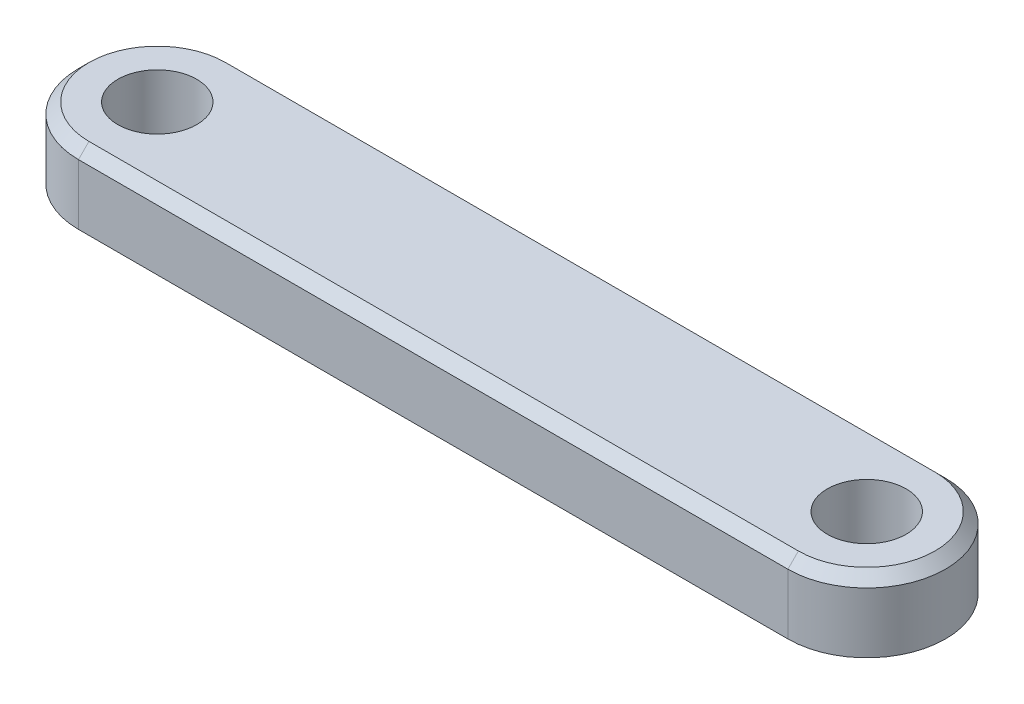
ISO-10303-21;
HEADER;
FILE_DESCRIPTION(('STEP AP214'),'2;1');
FILE_NAME('part.step','',(''),(''),'','','');
FILE_SCHEMA(('AUTOMOTIVE_DESIGN { 1 0 10303 214 1 1 1 1 }'));
ENDSEC;
DATA;
#1=APPLICATION_CONTEXT('core data for automotive mechanical design processes');
#2=APPLICATION_PROTOCOL_DEFINITION('international standard','automotive_design',2000,#1);
#3=PRODUCT_CONTEXT('',#1,'mechanical');
#4=PRODUCT('Part','Part','',(#3));
#5=PRODUCT_RELATED_PRODUCT_CATEGORY('part','',(#4));
#6=PRODUCT_DEFINITION_FORMATION('','',#4);
#7=PRODUCT_DEFINITION_CONTEXT('part definition',#1,'design');
#8=PRODUCT_DEFINITION('design','',#6,#7);
#9=PRODUCT_DEFINITION_SHAPE('','',#8);
#10=(LENGTH_UNIT() NAMED_UNIT(*) SI_UNIT(.MILLI.,.METRE.));
#11=(NAMED_UNIT(*) PLANE_ANGLE_UNIT() SI_UNIT($,.RADIAN.));
#12=(NAMED_UNIT(*) SI_UNIT($,.STERADIAN.) SOLID_ANGLE_UNIT());
#13=UNCERTAINTY_MEASURE_WITH_UNIT(LENGTH_MEASURE(1.E-05),#10,'distance_accuracy_value','');
#14=(GEOMETRIC_REPRESENTATION_CONTEXT(3) GLOBAL_UNCERTAINTY_ASSIGNED_CONTEXT((#13)) GLOBAL_UNIT_ASSIGNED_CONTEXT((#10,
#11,#12)) REPRESENTATION_CONTEXT('',''));
#15=CARTESIAN_POINT('',(0.,0.,0.));
#16=DIRECTION('',(0.,0.,1.));
#17=DIRECTION('',(1.,0.,0.));
#18=AXIS2_PLACEMENT_3D('',#15,#16,#17);
#19=CARTESIAN_POINT('',(-13.5,1.35,0.));
#20=DIRECTION('',(0.,1.,0.));
#21=DIRECTION('',(0.,0.,1.));
#22=AXIS2_PLACEMENT_3D('',#19,#20,#21);
#23=PLANE('',#22);
#24=DIRECTION('',(1.,0.,0.));
#25=VECTOR('',#24,1.);
#26=CARTESIAN_POINT('',(13.5,1.35,2.6));
#27=LINE('',#26,#25);
#28=CARTESIAN_POINT('',(-13.5,1.35,2.60000000000001));
#29=VERTEX_POINT('',#28);
#30=CARTESIAN_POINT('',(13.5,1.35,2.6));
#31=VERTEX_POINT('',#30);
#32=EDGE_CURVE('E105',#29,#31,#27,.T.);
#33=ORIENTED_EDGE('',*,*,#32,.T.);
#34=CARTESIAN_POINT('',(13.5,1.35,0.));
#35=DIRECTION('',(0.,1.,0.));
#36=DIRECTION('',(0.,0.,1.));
#37=AXIS2_PLACEMENT_3D('',#34,#35,#36);
#38=CIRCLE('',#37,2.60000000000001);
#39=CARTESIAN_POINT('',(13.5,1.35,-2.60000000000001));
#40=VERTEX_POINT('',#39);
#41=EDGE_CURVE('E150',#31,#40,#38,.T.);
#42=ORIENTED_EDGE('',*,*,#41,.T.);
#43=DIRECTION('',(-1.,0.,0.));
#44=VECTOR('',#43,1.);
#45=CARTESIAN_POINT('',(-13.5,1.35,-2.60000000000001));
#46=LINE('',#45,#44);
#47=CARTESIAN_POINT('',(-13.5,1.35,-2.6));
#48=VERTEX_POINT('',#47);
#49=EDGE_CURVE('E147',#40,#48,#46,.T.);
#50=ORIENTED_EDGE('',*,*,#49,.T.);
#51=CARTESIAN_POINT('',(-13.5,1.35,0.));
#52=DIRECTION('',(0.,1.,0.));
#53=DIRECTION('',(0.,0.,1.));
#54=AXIS2_PLACEMENT_3D('',#51,#52,#53);
#55=CIRCLE('',#54,2.60000000000001);
#56=EDGE_CURVE('E144',#48,#29,#55,.T.);
#57=ORIENTED_EDGE('',*,*,#56,.T.);
#58=EDGE_LOOP('',(#33,#42,#50,#57));
#59=FACE_BOUND('',#58,.T.);
#60=CARTESIAN_POINT('',(-13.5,1.35,0.));
#61=DIRECTION('',(0.,1.,0.));
#62=DIRECTION('',(0.,0.,1.));
#63=AXIS2_PLACEMENT_3D('',#60,#61,#62);
#64=CIRCLE('',#63,1.5);
#65=CARTESIAN_POINT('',(-13.5,1.35,1.5));
#66=VERTEX_POINT('',#65);
#67=EDGE_CURVE('E122',#66,#66,#64,.T.);
#68=ORIENTED_EDGE('',*,*,#67,.F.);
#69=EDGE_LOOP('',(#68));
#70=FACE_BOUND('',#69,.T.);
#71=CARTESIAN_POINT('',(13.5,1.35,0.));
#72=DIRECTION('',(0.,1.,0.));
#73=DIRECTION('',(0.,0.,-1.));
#74=AXIS2_PLACEMENT_3D('',#71,#72,#73);
#75=CIRCLE('',#74,1.5);
#76=CARTESIAN_POINT('',(13.5,1.35,-1.5));
#77=VERTEX_POINT('',#76);
#78=EDGE_CURVE('E183',#77,#77,#75,.T.);
#79=ORIENTED_EDGE('',*,*,#78,.F.);
#80=EDGE_LOOP('',(#79));
#81=FACE_BOUND('',#80,.T.);
#82=ADVANCED_FACE('F45',(#59,#70,#81),#23,.T.);
#83=CARTESIAN_POINT('',(-13.5,-1.35,0.));
#84=DIRECTION('',(0.,1.,0.));
#85=DIRECTION('',(0.,0.,1.));
#86=AXIS2_PLACEMENT_3D('',#83,#84,#85);
#87=PLANE('',#86);
#88=CARTESIAN_POINT('',(-13.5,-1.35,0.));
#89=DIRECTION('',(0.,1.,0.));
#90=DIRECTION('',(0.,0.,1.));
#91=AXIS2_PLACEMENT_3D('',#88,#89,#90);
#92=CIRCLE('',#91,3.);
#93=CARTESIAN_POINT('',(-13.5,-1.35,-3.));
#94=VERTEX_POINT('',#93);
#95=CARTESIAN_POINT('',(-13.5,-1.35,3.));
#96=VERTEX_POINT('',#95);
#97=EDGE_CURVE('E113',#94,#96,#92,.T.);
#98=ORIENTED_EDGE('',*,*,#97,.F.);
#99=DIRECTION('',(-1.,0.,0.));
#100=VECTOR('',#99,1.);
#101=CARTESIAN_POINT('',(-13.5,-1.35,-3.));
#102=LINE('',#101,#100);
#103=CARTESIAN_POINT('',(13.5,-1.35,-3.00000000000001));
#104=VERTEX_POINT('',#103);
#105=EDGE_CURVE('E132',#104,#94,#102,.T.);
#106=ORIENTED_EDGE('',*,*,#105,.F.);
#107=CARTESIAN_POINT('',(13.5,-1.35,0.));
#108=DIRECTION('',(0.,1.,0.));
#109=DIRECTION('',(0.,0.,1.));
#110=AXIS2_PLACEMENT_3D('',#107,#108,#109);
#111=CIRCLE('',#110,3.);
#112=CARTESIAN_POINT('',(13.5,-1.35,3.));
#113=VERTEX_POINT('',#112);
#114=EDGE_CURVE('E115',#113,#104,#111,.T.);
#115=ORIENTED_EDGE('',*,*,#114,.F.);
#116=DIRECTION('',(1.,0.,0.));
#117=VECTOR('',#116,1.);
#118=CARTESIAN_POINT('',(-13.5,-1.35,3.));
#119=LINE('',#118,#117);
#120=EDGE_CURVE('E101',#96,#113,#119,.T.);
#121=ORIENTED_EDGE('',*,*,#120,.F.);
#122=EDGE_LOOP('',(#98,#106,#115,#121));
#123=FACE_BOUND('',#122,.T.);
#124=CARTESIAN_POINT('',(-13.5,-1.35,0.));
#125=DIRECTION('',(0.,1.,0.));
#126=DIRECTION('',(0.,0.,1.));
#127=AXIS2_PLACEMENT_3D('',#124,#125,#126);
#128=CIRCLE('',#127,1.5);
#129=CARTESIAN_POINT('',(-13.5,-1.35,1.5));
#130=VERTEX_POINT('',#129);
#131=EDGE_CURVE('E126',#130,#130,#128,.T.);
#132=ORIENTED_EDGE('',*,*,#131,.T.);
#133=EDGE_LOOP('',(#132));
#134=FACE_BOUND('',#133,.T.);
#135=CARTESIAN_POINT('',(13.5,-1.35,0.));
#136=DIRECTION('',(0.,1.,0.));
#137=DIRECTION('',(0.,0.,-1.));
#138=AXIS2_PLACEMENT_3D('',#135,#136,#137);
#139=CIRCLE('',#138,1.5);
#140=CARTESIAN_POINT('',(13.5,-1.35,-1.5));
#141=VERTEX_POINT('',#140);
#142=EDGE_CURVE('E177',#141,#141,#139,.T.);
#143=ORIENTED_EDGE('',*,*,#142,.T.);
#144=EDGE_LOOP('',(#143));
#145=FACE_BOUND('',#144,.T.);
#146=ADVANCED_FACE('F110',(#123,#134,#145),#87,.F.);
#147=CARTESIAN_POINT('',(-13.5,1.35,0.));
#148=DIRECTION('',(0.,-1.,0.));
#149=DIRECTION('',(0.,0.,-1.));
#150=AXIS2_PLACEMENT_3D('',#147,#148,#149);
#151=CYLINDRICAL_SURFACE('',#150,3.);
#152=DIRECTION('',(0.,-1.,0.));
#153=VECTOR('',#152,1.);
#154=CARTESIAN_POINT('',(-13.5,1.35,3.));
#155=LINE('',#154,#153);
#156=CARTESIAN_POINT('',(-13.5,0.949999999999999,3.));
#157=VERTEX_POINT('',#156);
#158=EDGE_CURVE('E98',#157,#96,#155,.T.);
#159=ORIENTED_EDGE('',*,*,#158,.F.);
#160=CARTESIAN_POINT('',(-13.5,0.949999999999999,0.));
#161=DIRECTION('',(0.,1.,0.));
#162=DIRECTION('',(0.,0.,1.));
#163=AXIS2_PLACEMENT_3D('',#160,#161,#162);
#164=CIRCLE('',#163,3.);
#165=CARTESIAN_POINT('',(-13.5,0.949999999999999,-3.));
#166=VERTEX_POINT('',#165);
#167=EDGE_CURVE('E56',#157,#166,#164,.F.);
#168=ORIENTED_EDGE('',*,*,#167,.T.);
#169=DIRECTION('',(0.,-1.,0.));
#170=VECTOR('',#169,1.);
#171=CARTESIAN_POINT('',(-13.5,1.35,-3.));
#172=LINE('',#171,#170);
#173=EDGE_CURVE('E119',#166,#94,#172,.T.);
#174=ORIENTED_EDGE('',*,*,#173,.T.);
#175=ORIENTED_EDGE('',*,*,#97,.T.);
#176=EDGE_LOOP('',(#159,#168,#174,#175));
#177=FACE_BOUND('',#176,.T.);
#178=ADVANCED_FACE('F118',(#177),#151,.T.);
#179=CARTESIAN_POINT('',(-13.5,1.35,3.));
#180=DIRECTION('',(0.,0.,-1.));
#181=DIRECTION('',(-1.,0.,0.));
#182=AXIS2_PLACEMENT_3D('',#179,#180,#181);
#183=PLANE('',#182);
#184=DIRECTION('',(0.,-1.,0.));
#185=VECTOR('',#184,1.);
#186=CARTESIAN_POINT('',(13.5,1.35,3.));
#187=LINE('',#186,#185);
#188=CARTESIAN_POINT('',(13.5,0.949999999999999,3.));
#189=VERTEX_POINT('',#188);
#190=EDGE_CURVE('E106',#189,#113,#187,.T.);
#191=ORIENTED_EDGE('',*,*,#190,.F.);
#192=DIRECTION('',(-1.,0.,0.));
#193=VECTOR('',#192,1.);
#194=CARTESIAN_POINT('',(-13.5,0.949999999999999,3.));
#195=LINE('',#194,#193);
#196=EDGE_CURVE('E11',#189,#157,#195,.T.);
#197=ORIENTED_EDGE('',*,*,#196,.T.);
#198=ORIENTED_EDGE('',*,*,#158,.T.);
#199=ORIENTED_EDGE('',*,*,#120,.T.);
#200=EDGE_LOOP('',(#191,#197,#198,#199));
#201=FACE_BOUND('',#200,.T.);
#202=ADVANCED_FACE('F100',(#201),#183,.F.);
#203=CARTESIAN_POINT('',(13.5,1.35,0.));
#204=DIRECTION('',(0.,-1.,0.));
#205=DIRECTION('',(0.,0.,-1.));
#206=AXIS2_PLACEMENT_3D('',#203,#204,#205);
#207=CYLINDRICAL_SURFACE('',#206,3.);
#208=DIRECTION('',(0.,-1.,0.));
#209=VECTOR('',#208,1.);
#210=CARTESIAN_POINT('',(13.5,1.35,-3.00000000000001));
#211=LINE('',#210,#209);
#212=CARTESIAN_POINT('',(13.5,0.949999999999999,-3.00000000000001));
#213=VERTEX_POINT('',#212);
#214=EDGE_CURVE('E137',#213,#104,#211,.T.);
#215=ORIENTED_EDGE('',*,*,#214,.F.);
#216=CARTESIAN_POINT('',(13.5,0.949999999999999,0.));
#217=DIRECTION('',(0.,1.,0.));
#218=DIRECTION('',(0.,0.,1.));
#219=AXIS2_PLACEMENT_3D('',#216,#217,#218);
#220=CIRCLE('',#219,3.);
#221=EDGE_CURVE('E154',#213,#189,#220,.F.);
#222=ORIENTED_EDGE('',*,*,#221,.T.);
#223=ORIENTED_EDGE('',*,*,#190,.T.);
#224=ORIENTED_EDGE('',*,*,#114,.T.);
#225=EDGE_LOOP('',(#215,#222,#223,#224));
#226=FACE_BOUND('',#225,.T.);
#227=ADVANCED_FACE('F207',(#226),#207,.T.);
#228=CARTESIAN_POINT('',(-13.5,1.35,-3.));
#229=DIRECTION('',(0.,0.,1.));
#230=DIRECTION('',(1.,0.,0.));
#231=AXIS2_PLACEMENT_3D('',#228,#229,#230);
#232=PLANE('',#231);
#233=ORIENTED_EDGE('',*,*,#173,.F.);
#234=DIRECTION('',(1.,0.,0.));
#235=VECTOR('',#234,1.);
#236=CARTESIAN_POINT('',(13.5,0.949999999999999,-3.00000000000001));
#237=LINE('',#236,#235);
#238=EDGE_CURVE('E158',#166,#213,#237,.T.);
#239=ORIENTED_EDGE('',*,*,#238,.T.);
#240=ORIENTED_EDGE('',*,*,#214,.T.);
#241=ORIENTED_EDGE('',*,*,#105,.T.);
#242=EDGE_LOOP('',(#233,#239,#240,#241));
#243=FACE_BOUND('',#242,.T.);
#244=ADVANCED_FACE('F199',(#243),#232,.F.);
#245=CARTESIAN_POINT('',(-13.5,1.35,0.));
#246=DIRECTION('',(0.,-1.,0.));
#247=DIRECTION('',(0.,0.,-1.));
#248=AXIS2_PLACEMENT_3D('',#245,#246,#247);
#249=CYLINDRICAL_SURFACE('',#248,1.5);
#250=ORIENTED_EDGE('',*,*,#67,.T.);
#251=EDGE_LOOP('',(#250));
#252=FACE_BOUND('',#251,.T.);
#253=ORIENTED_EDGE('',*,*,#131,.F.);
#254=EDGE_LOOP('',(#253));
#255=FACE_BOUND('',#254,.T.);
#256=ADVANCED_FACE('F196',(#252,#255),#249,.F.);
#257=CARTESIAN_POINT('',(13.5,1.35,0.));
#258=DIRECTION('',(0.,-1.,0.));
#259=DIRECTION('',(0.,0.,-1.));
#260=AXIS2_PLACEMENT_3D('',#257,#258,#259);
#261=CYLINDRICAL_SURFACE('',#260,1.5);
#262=ORIENTED_EDGE('',*,*,#78,.T.);
#263=EDGE_LOOP('',(#262));
#264=FACE_BOUND('',#263,.T.);
#265=ORIENTED_EDGE('',*,*,#142,.F.);
#266=EDGE_LOOP('',(#265));
#267=FACE_BOUND('',#266,.T.);
#268=ADVANCED_FACE('F198',(#264,#267),#261,.F.);
#269=CARTESIAN_POINT('',(-13.5,1.35,0.));
#270=DIRECTION('',(0.,-1.,0.));
#271=DIRECTION('',(0.,0.,-1.));
#272=AXIS2_PLACEMENT_3D('',#269,#270,#271);
#273=CONICAL_SURFACE('',#272,2.60000000000001,0.785398163397444);
#274=DIRECTION('',(0.,0.707106781186551,0.707106781186544));
#275=VECTOR('',#274,1.);
#276=CARTESIAN_POINT('',(-13.5,0.949999999999999,-3.));
#277=LINE('',#276,#275);
#278=EDGE_CURVE('E168',#166,#48,#277,.T.);
#279=ORIENTED_EDGE('',*,*,#278,.F.);
#280=ORIENTED_EDGE('',*,*,#167,.F.);
#281=DIRECTION('',(0.,-0.707106781186551,0.707106781186544));
#282=VECTOR('',#281,1.);
#283=CARTESIAN_POINT('',(-13.5,1.35,2.60000000000001));
#284=LINE('',#283,#282);
#285=EDGE_CURVE('E50',#29,#157,#284,.T.);
#286=ORIENTED_EDGE('',*,*,#285,.F.);
#287=ORIENTED_EDGE('',*,*,#56,.F.);
#288=EDGE_LOOP('',(#279,#280,#286,#287));
#289=FACE_BOUND('',#288,.T.);
#290=ADVANCED_FACE('F48',(#289),#273,.T.);
#291=CARTESIAN_POINT('',(-13.5,1.35,2.60000000000001));
#292=DIRECTION('',(0.,0.707106781186544,0.707106781186551));
#293=DIRECTION('',(-1.,0.,0.));
#294=AXIS2_PLACEMENT_3D('',#291,#292,#293);
#295=PLANE('',#294);
#296=ORIENTED_EDGE('',*,*,#285,.T.);
#297=ORIENTED_EDGE('',*,*,#196,.F.);
#298=DIRECTION('',(0.,-0.707106781186551,0.707106781186544));
#299=VECTOR('',#298,1.);
#300=CARTESIAN_POINT('',(13.5,1.35,2.6));
#301=LINE('',#300,#299);
#302=EDGE_CURVE('E166',#31,#189,#301,.T.);
#303=ORIENTED_EDGE('',*,*,#302,.F.);
#304=ORIENTED_EDGE('',*,*,#32,.F.);
#305=EDGE_LOOP('',(#296,#297,#303,#304));
#306=FACE_BOUND('',#305,.T.);
#307=ADVANCED_FACE('F239',(#306),#295,.T.);
#308=CARTESIAN_POINT('',(-13.5,1.35,-2.60000000000001));
#309=DIRECTION('',(0.,0.707106781186544,-0.707106781186551));
#310=DIRECTION('',(1.,0.,0.));
#311=AXIS2_PLACEMENT_3D('',#308,#309,#310);
#312=PLANE('',#311);
#313=ORIENTED_EDGE('',*,*,#278,.T.);
#314=ORIENTED_EDGE('',*,*,#49,.F.);
#315=DIRECTION('',(0.,0.707106781186551,0.707106781186544));
#316=VECTOR('',#315,1.);
#317=CARTESIAN_POINT('',(13.5,0.949999999999999,-3.00000000000001));
#318=LINE('',#317,#316);
#319=EDGE_CURVE('E163',#213,#40,#318,.T.);
#320=ORIENTED_EDGE('',*,*,#319,.F.);
#321=ORIENTED_EDGE('',*,*,#238,.F.);
#322=EDGE_LOOP('',(#313,#314,#320,#321));
#323=FACE_BOUND('',#322,.T.);
#324=ADVANCED_FACE('F233',(#323),#312,.T.);
#325=CARTESIAN_POINT('',(13.5,1.35,0.));
#326=DIRECTION('',(0.,-1.,0.));
#327=DIRECTION('',(0.,0.,-1.));
#328=AXIS2_PLACEMENT_3D('',#325,#326,#327);
#329=CONICAL_SURFACE('',#328,2.60000000000001,0.785398163397444);
#330=ORIENTED_EDGE('',*,*,#302,.T.);
#331=ORIENTED_EDGE('',*,*,#221,.F.);
#332=ORIENTED_EDGE('',*,*,#319,.T.);
#333=ORIENTED_EDGE('',*,*,#41,.F.);
#334=EDGE_LOOP('',(#330,#331,#332,#333));
#335=FACE_BOUND('',#334,.T.);
#336=ADVANCED_FACE('F227',(#335),#329,.T.);
#337=CLOSED_SHELL('',(#82,#146,#178,#202,#227,#244,#256,#268,#290,#307,#324,#336));
#338=MANIFOLD_SOLID_BREP('B2',#337);
#339=ADVANCED_BREP_SHAPE_REPRESENTATION('',(#18,#338),#14);
#340=SHAPE_DEFINITION_REPRESENTATION(#9,#339);
ENDSEC;
END-ISO-10303-21;
